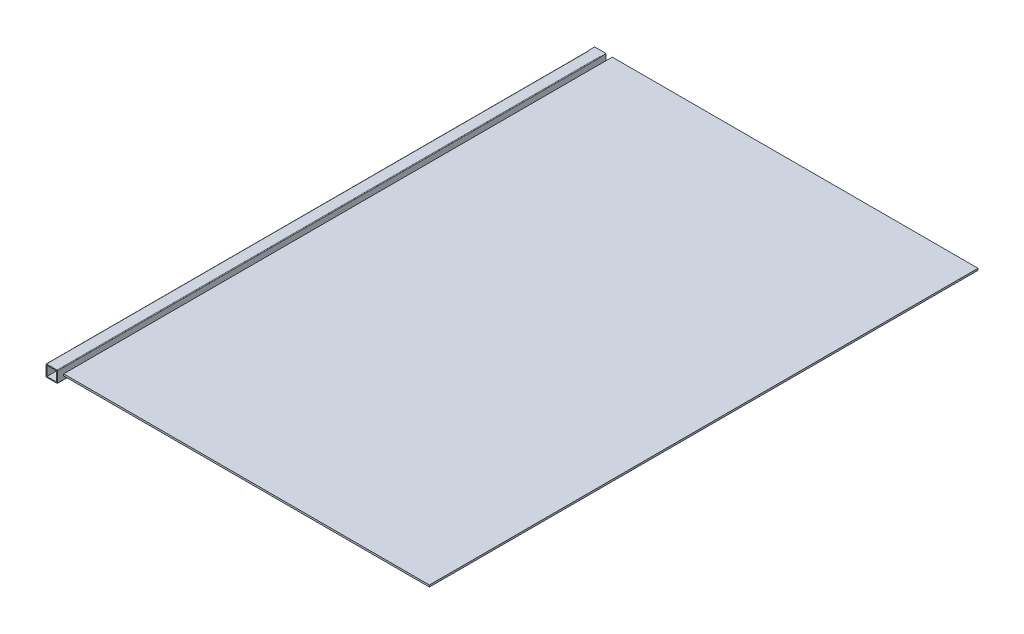
ISO-10303-21;
HEADER;
FILE_DESCRIPTION(('STEP AP214'),'2;1');
FILE_NAME('part.step','',(''),(''),'','','');
FILE_SCHEMA(('AUTOMOTIVE_DESIGN { 1 0 10303 214 1 1 1 1 }'));
ENDSEC;
DATA;
#1=APPLICATION_CONTEXT('core data for automotive mechanical design processes');
#2=APPLICATION_PROTOCOL_DEFINITION('international standard','automotive_design',2000,#1);
#3=PRODUCT_CONTEXT('',#1,'mechanical');
#4=PRODUCT('Part','Part','',(#3));
#5=PRODUCT_RELATED_PRODUCT_CATEGORY('part','',(#4));
#6=PRODUCT_DEFINITION_FORMATION('','',#4);
#7=PRODUCT_DEFINITION_CONTEXT('part definition',#1,'design');
#8=PRODUCT_DEFINITION('design','',#6,#7);
#9=PRODUCT_DEFINITION_SHAPE('','',#8);
#10=(LENGTH_UNIT() NAMED_UNIT(*) SI_UNIT(.MILLI.,.METRE.));
#11=(NAMED_UNIT(*) PLANE_ANGLE_UNIT() SI_UNIT($,.RADIAN.));
#12=(NAMED_UNIT(*) SI_UNIT($,.STERADIAN.) SOLID_ANGLE_UNIT());
#13=UNCERTAINTY_MEASURE_WITH_UNIT(LENGTH_MEASURE(1.E-05),#10,'distance_accuracy_value','');
#14=(GEOMETRIC_REPRESENTATION_CONTEXT(3) GLOBAL_UNCERTAINTY_ASSIGNED_CONTEXT((#13)) GLOBAL_UNIT_ASSIGNED_CONTEXT((#10,
#11,#12)) REPRESENTATION_CONTEXT('',''));
#15=CARTESIAN_POINT('',(0.,0.,0.));
#16=DIRECTION('',(0.,0.,1.));
#17=DIRECTION('',(1.,0.,0.));
#18=AXIS2_PLACEMENT_3D('',#15,#16,#17);
#19=CARTESIAN_POINT('',(29.,0.,900.));
#20=DIRECTION('',(1.,0.,0.));
#21=DIRECTION('',(0.,1.,0.));
#22=AXIS2_PLACEMENT_3D('',#19,#20,#21);
#23=PLANE('',#22);
#24=DIRECTION('',(0.,0.,-1.));
#25=VECTOR('',#24,1.);
#26=CARTESIAN_POINT('',(29.,0.,900.));
#27=LINE('',#26,#25);
#28=CARTESIAN_POINT('',(29.,0.,900.));
#29=VERTEX_POINT('',#28);
#30=CARTESIAN_POINT('',(29.,0.,0.));
#31=VERTEX_POINT('',#30);
#32=EDGE_CURVE('E83',#29,#31,#27,.T.);
#33=ORIENTED_EDGE('',*,*,#32,.T.);
#34=DIRECTION('',(0.,-1.,0.));
#35=VECTOR('',#34,1.);
#36=CARTESIAN_POINT('',(29.,0.,0.));
#37=LINE('',#36,#35);
#38=CARTESIAN_POINT('',(29.,-3.,0.));
#39=VERTEX_POINT('',#38);
#40=EDGE_CURVE('E107',#31,#39,#37,.T.);
#41=ORIENTED_EDGE('',*,*,#40,.T.);
#42=DIRECTION('',(0.,0.,-1.));
#43=VECTOR('',#42,1.);
#44=CARTESIAN_POINT('',(29.,-3.,900.));
#45=LINE('',#44,#43);
#46=CARTESIAN_POINT('',(29.,-3.,900.));
#47=VERTEX_POINT('',#46);
#48=EDGE_CURVE('E12',#47,#39,#45,.T.);
#49=ORIENTED_EDGE('',*,*,#48,.F.);
#50=DIRECTION('',(0.,-1.,0.));
#51=VECTOR('',#50,1.);
#52=CARTESIAN_POINT('',(29.,0.,900.));
#53=LINE('',#52,#51);
#54=EDGE_CURVE('E93',#29,#47,#53,.T.);
#55=ORIENTED_EDGE('',*,*,#54,.F.);
#56=EDGE_LOOP('',(#33,#41,#49,#55));
#57=FACE_BOUND('',#56,.T.);
#58=ADVANCED_FACE('F45',(#57),#23,.F.);
#59=CARTESIAN_POINT('',(29.,-3.,900.));
#60=DIRECTION('',(0.,1.,0.));
#61=DIRECTION('',(0.,0.,1.));
#62=AXIS2_PLACEMENT_3D('',#59,#60,#61);
#63=PLANE('',#62);
#64=ORIENTED_EDGE('',*,*,#48,.T.);
#65=DIRECTION('',(1.,0.,0.));
#66=VECTOR('',#65,1.);
#67=CARTESIAN_POINT('',(29.,-3.,0.));
#68=LINE('',#67,#66);
#69=CARTESIAN_POINT('',(629.,-3.,0.));
#70=VERTEX_POINT('',#69);
#71=EDGE_CURVE('E99',#39,#70,#68,.T.);
#72=ORIENTED_EDGE('',*,*,#71,.T.);
#73=DIRECTION('',(0.,0.,-1.));
#74=VECTOR('',#73,1.);
#75=CARTESIAN_POINT('',(629.,-3.,900.));
#76=LINE('',#75,#74);
#77=CARTESIAN_POINT('',(629.,-3.,900.));
#78=VERTEX_POINT('',#77);
#79=EDGE_CURVE('E53',#78,#70,#76,.T.);
#80=ORIENTED_EDGE('',*,*,#79,.F.);
#81=DIRECTION('',(1.,0.,0.));
#82=VECTOR('',#81,1.);
#83=CARTESIAN_POINT('',(29.,-3.,900.));
#84=LINE('',#83,#82);
#85=EDGE_CURVE('E89',#47,#78,#84,.T.);
#86=ORIENTED_EDGE('',*,*,#85,.F.);
#87=EDGE_LOOP('',(#64,#72,#80,#86));
#88=FACE_BOUND('',#87,.T.);
#89=ADVANCED_FACE('F97',(#88),#63,.F.);
#90=CARTESIAN_POINT('',(629.,0.,900.));
#91=DIRECTION('',(-1.,0.,0.));
#92=DIRECTION('',(0.,0.,1.));
#93=AXIS2_PLACEMENT_3D('',#90,#91,#92);
#94=PLANE('',#93);
#95=ORIENTED_EDGE('',*,*,#79,.T.);
#96=DIRECTION('',(0.,1.,0.));
#97=VECTOR('',#96,1.);
#98=CARTESIAN_POINT('',(629.,0.,0.));
#99=LINE('',#98,#97);
#100=CARTESIAN_POINT('',(629.,0.,0.));
#101=VERTEX_POINT('',#100);
#102=EDGE_CURVE('E110',#70,#101,#99,.T.);
#103=ORIENTED_EDGE('',*,*,#102,.T.);
#104=DIRECTION('',(0.,0.,-1.));
#105=VECTOR('',#104,1.);
#106=CARTESIAN_POINT('',(629.,0.,900.));
#107=LINE('',#106,#105);
#108=CARTESIAN_POINT('',(629.,0.,900.));
#109=VERTEX_POINT('',#108);
#110=EDGE_CURVE('E76',#109,#101,#107,.T.);
#111=ORIENTED_EDGE('',*,*,#110,.F.);
#112=DIRECTION('',(0.,1.,0.));
#113=VECTOR('',#112,1.);
#114=CARTESIAN_POINT('',(629.,0.,900.));
#115=LINE('',#114,#113);
#116=EDGE_CURVE('E92',#78,#109,#115,.T.);
#117=ORIENTED_EDGE('',*,*,#116,.F.);
#118=EDGE_LOOP('',(#95,#103,#111,#117));
#119=FACE_BOUND('',#118,.T.);
#120=ADVANCED_FACE('F102',(#119),#94,.F.);
#121=CARTESIAN_POINT('',(29.,0.,900.));
#122=DIRECTION('',(0.,-1.,0.));
#123=DIRECTION('',(0.,0.,-1.));
#124=AXIS2_PLACEMENT_3D('',#121,#122,#123);
#125=PLANE('',#124);
#126=ORIENTED_EDGE('',*,*,#110,.T.);
#127=DIRECTION('',(-1.,0.,0.));
#128=VECTOR('',#127,1.);
#129=CARTESIAN_POINT('',(29.,0.,0.));
#130=LINE('',#129,#128);
#131=EDGE_CURVE('E112',#101,#31,#130,.T.);
#132=ORIENTED_EDGE('',*,*,#131,.T.);
#133=ORIENTED_EDGE('',*,*,#32,.F.);
#134=DIRECTION('',(-1.,0.,0.));
#135=VECTOR('',#134,1.);
#136=CARTESIAN_POINT('',(29.,0.,900.));
#137=LINE('',#136,#135);
#138=EDGE_CURVE('E61',#109,#29,#137,.T.);
#139=ORIENTED_EDGE('',*,*,#138,.F.);
#140=EDGE_LOOP('',(#126,#132,#133,#139));
#141=FACE_BOUND('',#140,.T.);
#142=ADVANCED_FACE('F117',(#141),#125,.F.);
#143=CARTESIAN_POINT('',(0.,0.,900.));
#144=DIRECTION('',(0.,0.,1.));
#145=DIRECTION('',(1.,0.,0.));
#146=AXIS2_PLACEMENT_3D('',#143,#144,#145);
#147=PLANE('',#146);
#148=ORIENTED_EDGE('',*,*,#54,.T.);
#149=ORIENTED_EDGE('',*,*,#85,.T.);
#150=ORIENTED_EDGE('',*,*,#116,.T.);
#151=ORIENTED_EDGE('',*,*,#138,.T.);
#152=EDGE_LOOP('',(#148,#149,#150,#151));
#153=FACE_BOUND('',#152,.T.);
#154=ADVANCED_FACE('F90',(#153),#147,.T.);
#155=CARTESIAN_POINT('',(0.,0.,0.));
#156=DIRECTION('',(0.,0.,1.));
#157=DIRECTION('',(1.,0.,0.));
#158=AXIS2_PLACEMENT_3D('',#155,#156,#157);
#159=PLANE('',#158);
#160=ORIENTED_EDGE('',*,*,#40,.F.);
#161=ORIENTED_EDGE('',*,*,#131,.F.);
#162=ORIENTED_EDGE('',*,*,#102,.F.);
#163=ORIENTED_EDGE('',*,*,#71,.F.);
#164=EDGE_LOOP('',(#160,#161,#162,#163));
#165=FACE_BOUND('',#164,.T.);
#166=ADVANCED_FACE('F119',(#165),#159,.F.);
#167=CLOSED_SHELL('',(#58,#89,#120,#142,#154,#166));
#168=MANIFOLD_SOLID_BREP('B2',#167);
#169=CARTESIAN_POINT('',(0.,0.,900.));
#170=DIRECTION('',(0.,0.,1.));
#171=DIRECTION('',(1.,0.,0.));
#172=AXIS2_PLACEMENT_3D('',#169,#170,#171);
#173=PLANE('',#172);
#174=DIRECTION('',(0.,-1.,0.));
#175=VECTOR('',#174,1.);
#176=CARTESIAN_POINT('',(0.,0.,900.));
#177=LINE('',#176,#175);
#178=CARTESIAN_POINT('',(0.,-1.,900.));
#179=VERTEX_POINT('',#178);
#180=CARTESIAN_POINT('',(0.,-18.,900.));
#181=VERTEX_POINT('',#180);
#182=EDGE_CURVE('E348',#179,#181,#177,.T.);
#183=ORIENTED_EDGE('',*,*,#182,.T.);
#184=CARTESIAN_POINT('',(1.,-18.,900.));
#185=DIRECTION('',(0.,0.,1.));
#186=DIRECTION('',(1.,0.,0.));
#187=AXIS2_PLACEMENT_3D('',#184,#185,#186);
#188=CIRCLE('',#187,1.);
#189=CARTESIAN_POINT('',(1.,-19.,900.));
#190=VERTEX_POINT('',#189);
#191=EDGE_CURVE('E380',#181,#190,#188,.T.);
#192=ORIENTED_EDGE('',*,*,#191,.T.);
#193=DIRECTION('',(1.,0.,0.));
#194=VECTOR('',#193,1.);
#195=CARTESIAN_POINT('',(0.,-19.,900.));
#196=LINE('',#195,#194);
#197=CARTESIAN_POINT('',(18.,-19.,900.));
#198=VERTEX_POINT('',#197);
#199=EDGE_CURVE('E351',#190,#198,#196,.T.);
#200=ORIENTED_EDGE('',*,*,#199,.T.);
#201=CARTESIAN_POINT('',(18.,-18.,900.));
#202=DIRECTION('',(0.,0.,1.));
#203=DIRECTION('',(1.,0.,0.));
#204=AXIS2_PLACEMENT_3D('',#201,#202,#203);
#205=CIRCLE('',#204,1.);
#206=CARTESIAN_POINT('',(19.,-18.,900.));
#207=VERTEX_POINT('',#206);
#208=EDGE_CURVE('E376',#198,#207,#205,.T.);
#209=ORIENTED_EDGE('',*,*,#208,.T.);
#210=DIRECTION('',(0.,1.,0.));
#211=VECTOR('',#210,1.);
#212=CARTESIAN_POINT('',(19.,0.,900.));
#213=LINE('',#212,#211);
#214=CARTESIAN_POINT('',(19.,-1.,900.));
#215=VERTEX_POINT('',#214);
#216=EDGE_CURVE('E355',#207,#215,#213,.T.);
#217=ORIENTED_EDGE('',*,*,#216,.T.);
#218=CARTESIAN_POINT('',(18.,-1.,900.));
#219=DIRECTION('',(0.,0.,1.));
#220=DIRECTION('',(1.,0.,0.));
#221=AXIS2_PLACEMENT_3D('',#218,#219,#220);
#222=CIRCLE('',#221,1.);
#223=CARTESIAN_POINT('',(18.,0.,900.));
#224=VERTEX_POINT('',#223);
#225=EDGE_CURVE('E374',#215,#224,#222,.T.);
#226=ORIENTED_EDGE('',*,*,#225,.T.);
#227=DIRECTION('',(-1.,0.,0.));
#228=VECTOR('',#227,1.);
#229=CARTESIAN_POINT('',(0.,0.,900.));
#230=LINE('',#229,#228);
#231=CARTESIAN_POINT('',(1.,0.,900.));
#232=VERTEX_POINT('',#231);
#233=EDGE_CURVE('E358',#224,#232,#230,.T.);
#234=ORIENTED_EDGE('',*,*,#233,.T.);
#235=CARTESIAN_POINT('',(1.,-1.,900.));
#236=DIRECTION('',(0.,0.,1.));
#237=DIRECTION('',(1.,0.,0.));
#238=AXIS2_PLACEMENT_3D('',#235,#236,#237);
#239=CIRCLE('',#238,1.);
#240=EDGE_CURVE('E378',#232,#179,#239,.T.);
#241=ORIENTED_EDGE('',*,*,#240,.T.);
#242=EDGE_LOOP('',(#183,#192,#200,#209,#217,#226,#234,#241));
#243=FACE_BOUND('',#242,.T.);
#244=DIRECTION('',(1.,0.,0.));
#245=VECTOR('',#244,1.);
#246=CARTESIAN_POINT('',(1.56,-17.44,900.));
#247=LINE('',#246,#245);
#248=CARTESIAN_POINT('',(1.56,-17.44,900.));
#249=VERTEX_POINT('',#248);
#250=CARTESIAN_POINT('',(17.44,-17.44,900.));
#251=VERTEX_POINT('',#250);
#252=EDGE_CURVE('E322',#249,#251,#247,.T.);
#253=ORIENTED_EDGE('',*,*,#252,.F.);
#254=DIRECTION('',(0.,-1.,0.));
#255=VECTOR('',#254,1.);
#256=CARTESIAN_POINT('',(1.56,-1.56,900.));
#257=LINE('',#256,#255);
#258=CARTESIAN_POINT('',(1.56,-1.56,900.));
#259=VERTEX_POINT('',#258);
#260=EDGE_CURVE('E320',#259,#249,#257,.T.);
#261=ORIENTED_EDGE('',*,*,#260,.F.);
#262=DIRECTION('',(-1.,0.,0.));
#263=VECTOR('',#262,1.);
#264=CARTESIAN_POINT('',(1.56,-1.56,900.));
#265=LINE('',#264,#263);
#266=CARTESIAN_POINT('',(17.44,-1.56,900.));
#267=VERTEX_POINT('',#266);
#268=EDGE_CURVE('E328',#267,#259,#265,.T.);
#269=ORIENTED_EDGE('',*,*,#268,.F.);
#270=DIRECTION('',(0.,1.,0.));
#271=VECTOR('',#270,1.);
#272=CARTESIAN_POINT('',(17.44,-1.56,900.));
#273=LINE('',#272,#271);
#274=EDGE_CURVE('E325',#251,#267,#273,.T.);
#275=ORIENTED_EDGE('',*,*,#274,.F.);
#276=EDGE_LOOP('',(#253,#261,#269,#275));
#277=FACE_BOUND('',#276,.T.);
#278=ADVANCED_FACE('F169',(#243,#277),#173,.T.);
#279=CARTESIAN_POINT('',(0.,0.,0.));
#280=DIRECTION('',(0.,0.,1.));
#281=DIRECTION('',(1.,0.,0.));
#282=AXIS2_PLACEMENT_3D('',#279,#280,#281);
#283=PLANE('',#282);
#284=DIRECTION('',(1.,0.,0.));
#285=VECTOR('',#284,1.);
#286=CARTESIAN_POINT('',(0.,-19.,0.));
#287=LINE('',#286,#285);
#288=CARTESIAN_POINT('',(0.,-19.,0.));
#289=VERTEX_POINT('',#288);
#290=CARTESIAN_POINT('',(19.,-19.,0.));
#291=VERTEX_POINT('',#290);
#292=EDGE_CURVE('E362',#289,#291,#287,.T.);
#293=ORIENTED_EDGE('',*,*,#292,.F.);
#294=DIRECTION('',(0.,-1.,0.));
#295=VECTOR('',#294,1.);
#296=CARTESIAN_POINT('',(0.,0.,0.));
#297=LINE('',#296,#295);
#298=CARTESIAN_POINT('',(0.,0.,0.));
#299=VERTEX_POINT('',#298);
#300=EDGE_CURVE('E305',#299,#289,#297,.T.);
#301=ORIENTED_EDGE('',*,*,#300,.F.);
#302=DIRECTION('',(-1.,0.,0.));
#303=VECTOR('',#302,1.);
#304=CARTESIAN_POINT('',(0.,0.,0.));
#305=LINE('',#304,#303);
#306=CARTESIAN_POINT('',(19.,0.,0.));
#307=VERTEX_POINT('',#306);
#308=EDGE_CURVE('E352',#307,#299,#305,.T.);
#309=ORIENTED_EDGE('',*,*,#308,.F.);
#310=DIRECTION('',(0.,1.,0.));
#311=VECTOR('',#310,1.);
#312=CARTESIAN_POINT('',(19.,0.,0.));
#313=LINE('',#312,#311);
#314=EDGE_CURVE('E364',#291,#307,#313,.T.);
#315=ORIENTED_EDGE('',*,*,#314,.F.);
#316=EDGE_LOOP('',(#293,#301,#309,#315));
#317=FACE_BOUND('',#316,.T.);
#318=DIRECTION('',(0.,-1.,0.));
#319=VECTOR('',#318,1.);
#320=CARTESIAN_POINT('',(1.56,-1.56,0.));
#321=LINE('',#320,#319);
#322=CARTESIAN_POINT('',(1.56,-1.56,0.));
#323=VERTEX_POINT('',#322);
#324=CARTESIAN_POINT('',(1.56,-17.44,0.));
#325=VERTEX_POINT('',#324);
#326=EDGE_CURVE('E319',#323,#325,#321,.T.);
#327=ORIENTED_EDGE('',*,*,#326,.T.);
#328=DIRECTION('',(1.,0.,0.));
#329=VECTOR('',#328,1.);
#330=CARTESIAN_POINT('',(1.56,-17.44,0.));
#331=LINE('',#330,#329);
#332=CARTESIAN_POINT('',(17.44,-17.44,0.));
#333=VERTEX_POINT('',#332);
#334=EDGE_CURVE('E333',#325,#333,#331,.T.);
#335=ORIENTED_EDGE('',*,*,#334,.T.);
#336=DIRECTION('',(0.,1.,0.));
#337=VECTOR('',#336,1.);
#338=CARTESIAN_POINT('',(17.44,-1.56,0.));
#339=LINE('',#338,#337);
#340=CARTESIAN_POINT('',(17.44,-1.56,0.));
#341=VERTEX_POINT('',#340);
#342=EDGE_CURVE('E336',#333,#341,#339,.T.);
#343=ORIENTED_EDGE('',*,*,#342,.T.);
#344=DIRECTION('',(-1.,0.,0.));
#345=VECTOR('',#344,1.);
#346=CARTESIAN_POINT('',(1.56,-1.56,0.));
#347=LINE('',#346,#345);
#348=EDGE_CURVE('E323',#341,#323,#347,.T.);
#349=ORIENTED_EDGE('',*,*,#348,.T.);
#350=EDGE_LOOP('',(#327,#335,#343,#349));
#351=FACE_BOUND('',#350,.T.);
#352=ADVANCED_FACE('F417',(#317,#351),#283,.F.);
#353=CARTESIAN_POINT('',(0.,0.,900.));
#354=DIRECTION('',(1.,0.,0.));
#355=DIRECTION('',(0.,1.,0.));
#356=AXIS2_PLACEMENT_3D('',#353,#354,#355);
#357=PLANE('',#356);
#358=DIRECTION('',(0.,0.,-1.));
#359=VECTOR('',#358,1.);
#360=CARTESIAN_POINT('',(0.,-1.,900.));
#361=LINE('',#360,#359);
#362=CARTESIAN_POINT('',(0.,-1.,10.));
#363=VERTEX_POINT('',#362);
#364=EDGE_CURVE('E370',#179,#363,#361,.T.);
#365=ORIENTED_EDGE('',*,*,#364,.T.);
#366=DIRECTION('',(0.,-1.,0.));
#367=VECTOR('',#366,1.);
#368=CARTESIAN_POINT('',(0.,0.,10.));
#369=LINE('',#368,#367);
#370=CARTESIAN_POINT('',(0.,0.,10.));
#371=VERTEX_POINT('',#370);
#372=EDGE_CURVE('E289',#371,#363,#369,.T.);
#373=ORIENTED_EDGE('',*,*,#372,.F.);
#374=DIRECTION('',(0.,0.,-1.));
#375=VECTOR('',#374,1.);
#376=CARTESIAN_POINT('',(0.,0.,10.));
#377=LINE('',#376,#375);
#378=EDGE_CURVE('E407',#371,#299,#377,.T.);
#379=ORIENTED_EDGE('',*,*,#378,.T.);
#380=ORIENTED_EDGE('',*,*,#300,.T.);
#381=DIRECTION('',(0.,0.,-1.));
#382=VECTOR('',#381,1.);
#383=CARTESIAN_POINT('',(0.,-19.,10.));
#384=LINE('',#383,#382);
#385=CARTESIAN_POINT('',(0.,-19.,10.));
#386=VERTEX_POINT('',#385);
#387=EDGE_CURVE('E295',#386,#289,#384,.T.);
#388=ORIENTED_EDGE('',*,*,#387,.F.);
#389=CARTESIAN_POINT('',(0.,-18.,10.));
#390=VERTEX_POINT('',#389);
#391=EDGE_CURVE('E280',#390,#386,#369,.T.);
#392=ORIENTED_EDGE('',*,*,#391,.F.);
#393=DIRECTION('',(0.,0.,-1.));
#394=VECTOR('',#393,1.);
#395=CARTESIAN_POINT('',(0.,-18.,900.));
#396=LINE('',#395,#394);
#397=EDGE_CURVE('E372',#390,#181,#396,.F.);
#398=ORIENTED_EDGE('',*,*,#397,.T.);
#399=ORIENTED_EDGE('',*,*,#182,.F.);
#400=EDGE_LOOP('',(#365,#373,#379,#380,#388,#392,#398,#399));
#401=FACE_BOUND('',#400,.T.);
#402=ADVANCED_FACE('F303',(#401),#357,.F.);
#403=CARTESIAN_POINT('',(0.,-19.,900.));
#404=DIRECTION('',(0.,1.,0.));
#405=DIRECTION('',(0.,0.,1.));
#406=AXIS2_PLACEMENT_3D('',#403,#404,#405);
#407=PLANE('',#406);
#408=DIRECTION('',(0.,0.,-1.));
#409=VECTOR('',#408,1.);
#410=CARTESIAN_POINT('',(1.,-19.,900.));
#411=LINE('',#410,#409);
#412=CARTESIAN_POINT('',(1.,-19.,10.));
#413=VERTEX_POINT('',#412);
#414=EDGE_CURVE('E298',#190,#413,#411,.T.);
#415=ORIENTED_EDGE('',*,*,#414,.T.);
#416=DIRECTION('',(1.,0.,0.));
#417=VECTOR('',#416,1.);
#418=CARTESIAN_POINT('',(0.,-19.,10.));
#419=LINE('',#418,#417);
#420=EDGE_CURVE('E283',#386,#413,#419,.T.);
#421=ORIENTED_EDGE('',*,*,#420,.F.);
#422=ORIENTED_EDGE('',*,*,#387,.T.);
#423=ORIENTED_EDGE('',*,*,#292,.T.);
#424=DIRECTION('',(0.,0.,-1.));
#425=VECTOR('',#424,1.);
#426=CARTESIAN_POINT('',(19.,-19.,10.));
#427=LINE('',#426,#425);
#428=CARTESIAN_POINT('',(19.,-19.,10.));
#429=VERTEX_POINT('',#428);
#430=EDGE_CURVE('E308',#429,#291,#427,.T.);
#431=ORIENTED_EDGE('',*,*,#430,.F.);
#432=CARTESIAN_POINT('',(18.,-19.,10.));
#433=VERTEX_POINT('',#432);
#434=EDGE_CURVE('E300',#433,#429,#419,.T.);
#435=ORIENTED_EDGE('',*,*,#434,.F.);
#436=DIRECTION('',(0.,0.,-1.));
#437=VECTOR('',#436,1.);
#438=CARTESIAN_POINT('',(18.,-19.,900.));
#439=LINE('',#438,#437);
#440=EDGE_CURVE('E360',#433,#198,#439,.F.);
#441=ORIENTED_EDGE('',*,*,#440,.T.);
#442=ORIENTED_EDGE('',*,*,#199,.F.);
#443=EDGE_LOOP('',(#415,#421,#422,#423,#431,#435,#441,#442));
#444=FACE_BOUND('',#443,.T.);
#445=ADVANCED_FACE('F294',(#444),#407,.F.);
#446=CARTESIAN_POINT('',(19.,0.,900.));
#447=DIRECTION('',(-1.,0.,0.));
#448=DIRECTION('',(0.,0.,1.));
#449=AXIS2_PLACEMENT_3D('',#446,#447,#448);
#450=PLANE('',#449);
#451=DIRECTION('',(0.,0.,-1.));
#452=VECTOR('',#451,1.);
#453=CARTESIAN_POINT('',(19.,-18.,900.));
#454=LINE('',#453,#452);
#455=CARTESIAN_POINT('',(19.,-18.,10.));
#456=VERTEX_POINT('',#455);
#457=EDGE_CURVE('E177',#207,#456,#454,.T.);
#458=ORIENTED_EDGE('',*,*,#457,.T.);
#459=DIRECTION('',(0.,1.,0.));
#460=VECTOR('',#459,1.);
#461=CARTESIAN_POINT('',(19.,0.,10.));
#462=LINE('',#461,#460);
#463=EDGE_CURVE('E393',#429,#456,#462,.T.);
#464=ORIENTED_EDGE('',*,*,#463,.F.);
#465=ORIENTED_EDGE('',*,*,#430,.T.);
#466=ORIENTED_EDGE('',*,*,#314,.T.);
#467=DIRECTION('',(0.,0.,-1.));
#468=VECTOR('',#467,1.);
#469=CARTESIAN_POINT('',(19.,0.,10.));
#470=LINE('',#469,#468);
#471=CARTESIAN_POINT('',(19.,0.,10.));
#472=VERTEX_POINT('',#471);
#473=EDGE_CURVE('E313',#472,#307,#470,.T.);
#474=ORIENTED_EDGE('',*,*,#473,.F.);
#475=CARTESIAN_POINT('',(19.,-1.,10.));
#476=VERTEX_POINT('',#475);
#477=EDGE_CURVE('E299',#476,#472,#462,.T.);
#478=ORIENTED_EDGE('',*,*,#477,.F.);
#479=DIRECTION('',(0.,0.,-1.));
#480=VECTOR('',#479,1.);
#481=CARTESIAN_POINT('',(19.,-1.,900.));
#482=LINE('',#481,#480);
#483=EDGE_CURVE('E386',#476,#215,#482,.F.);
#484=ORIENTED_EDGE('',*,*,#483,.T.);
#485=ORIENTED_EDGE('',*,*,#216,.F.);
#486=EDGE_LOOP('',(#458,#464,#465,#466,#474,#478,#484,#485));
#487=FACE_BOUND('',#486,.T.);
#488=ADVANCED_FACE('F392',(#487),#450,.F.);
#489=CARTESIAN_POINT('',(0.,0.,900.));
#490=DIRECTION('',(0.,-1.,0.));
#491=DIRECTION('',(0.,0.,-1.));
#492=AXIS2_PLACEMENT_3D('',#489,#490,#491);
#493=PLANE('',#492);
#494=DIRECTION('',(0.,0.,-1.));
#495=VECTOR('',#494,1.);
#496=CARTESIAN_POINT('',(18.,0.,900.));
#497=LINE('',#496,#495);
#498=CARTESIAN_POINT('',(18.,0.,10.));
#499=VERTEX_POINT('',#498);
#500=EDGE_CURVE('E382',#224,#499,#497,.T.);
#501=ORIENTED_EDGE('',*,*,#500,.T.);
#502=DIRECTION('',(-1.,0.,0.));
#503=VECTOR('',#502,1.);
#504=CARTESIAN_POINT('',(0.,0.,10.));
#505=LINE('',#504,#503);
#506=EDGE_CURVE('E405',#472,#499,#505,.T.);
#507=ORIENTED_EDGE('',*,*,#506,.F.);
#508=ORIENTED_EDGE('',*,*,#473,.T.);
#509=ORIENTED_EDGE('',*,*,#308,.T.);
#510=ORIENTED_EDGE('',*,*,#378,.F.);
#511=CARTESIAN_POINT('',(1.,0.,10.));
#512=VERTEX_POINT('',#511);
#513=EDGE_CURVE('E184',#512,#371,#505,.T.);
#514=ORIENTED_EDGE('',*,*,#513,.F.);
#515=DIRECTION('',(0.,0.,-1.));
#516=VECTOR('',#515,1.);
#517=CARTESIAN_POINT('',(1.,0.,900.));
#518=LINE('',#517,#516);
#519=EDGE_CURVE('E189',#512,#232,#518,.F.);
#520=ORIENTED_EDGE('',*,*,#519,.T.);
#521=ORIENTED_EDGE('',*,*,#233,.F.);
#522=EDGE_LOOP('',(#501,#507,#508,#509,#510,#514,#520,#521));
#523=FACE_BOUND('',#522,.T.);
#524=ADVANCED_FACE('F411',(#523),#493,.F.);
#525=CARTESIAN_POINT('',(1.56,-1.56,900.));
#526=DIRECTION('',(1.,0.,0.));
#527=DIRECTION('',(0.,1.,0.));
#528=AXIS2_PLACEMENT_3D('',#525,#526,#527);
#529=PLANE('',#528);
#530=DIRECTION('',(0.,0.,-1.));
#531=VECTOR('',#530,1.);
#532=CARTESIAN_POINT('',(1.56,-17.44,900.));
#533=LINE('',#532,#531);
#534=EDGE_CURVE('E346',#249,#325,#533,.T.);
#535=ORIENTED_EDGE('',*,*,#534,.T.);
#536=ORIENTED_EDGE('',*,*,#326,.F.);
#537=DIRECTION('',(0.,0.,-1.));
#538=VECTOR('',#537,1.);
#539=CARTESIAN_POINT('',(1.56,-1.56,900.));
#540=LINE('',#539,#538);
#541=EDGE_CURVE('E330',#259,#323,#540,.T.);
#542=ORIENTED_EDGE('',*,*,#541,.F.);
#543=ORIENTED_EDGE('',*,*,#260,.T.);
#544=EDGE_LOOP('',(#535,#536,#542,#543));
#545=FACE_BOUND('',#544,.T.);
#546=ADVANCED_FACE('F426',(#545),#529,.T.);
#547=CARTESIAN_POINT('',(1.56,-17.44,900.));
#548=DIRECTION('',(0.,1.,0.));
#549=DIRECTION('',(0.,0.,1.));
#550=AXIS2_PLACEMENT_3D('',#547,#548,#549);
#551=PLANE('',#550);
#552=DIRECTION('',(0.,0.,-1.));
#553=VECTOR('',#552,1.);
#554=CARTESIAN_POINT('',(17.44,-17.44,900.));
#555=LINE('',#554,#553);
#556=EDGE_CURVE('E344',#251,#333,#555,.T.);
#557=ORIENTED_EDGE('',*,*,#556,.T.);
#558=ORIENTED_EDGE('',*,*,#334,.F.);
#559=ORIENTED_EDGE('',*,*,#534,.F.);
#560=ORIENTED_EDGE('',*,*,#252,.T.);
#561=EDGE_LOOP('',(#557,#558,#559,#560));
#562=FACE_BOUND('',#561,.T.);
#563=ADVANCED_FACE('F431',(#562),#551,.T.);
#564=CARTESIAN_POINT('',(17.44,-1.56,900.));
#565=DIRECTION('',(-1.,0.,0.));
#566=DIRECTION('',(0.,-1.,0.));
#567=AXIS2_PLACEMENT_3D('',#564,#565,#566);
#568=PLANE('',#567);
#569=DIRECTION('',(0.,0.,-1.));
#570=VECTOR('',#569,1.);
#571=CARTESIAN_POINT('',(17.44,-1.56,900.));
#572=LINE('',#571,#570);
#573=EDGE_CURVE('E342',#267,#341,#572,.T.);
#574=ORIENTED_EDGE('',*,*,#573,.T.);
#575=ORIENTED_EDGE('',*,*,#342,.F.);
#576=ORIENTED_EDGE('',*,*,#556,.F.);
#577=ORIENTED_EDGE('',*,*,#274,.T.);
#578=EDGE_LOOP('',(#574,#575,#576,#577));
#579=FACE_BOUND('',#578,.T.);
#580=ADVANCED_FACE('F436',(#579),#568,.T.);
#581=CARTESIAN_POINT('',(1.56,-1.56,900.));
#582=DIRECTION('',(0.,-1.,0.));
#583=DIRECTION('',(0.,0.,-1.));
#584=AXIS2_PLACEMENT_3D('',#581,#582,#583);
#585=PLANE('',#584);
#586=ORIENTED_EDGE('',*,*,#541,.T.);
#587=ORIENTED_EDGE('',*,*,#348,.F.);
#588=ORIENTED_EDGE('',*,*,#573,.F.);
#589=ORIENTED_EDGE('',*,*,#268,.T.);
#590=EDGE_LOOP('',(#586,#587,#588,#589));
#591=FACE_BOUND('',#590,.T.);
#592=ADVANCED_FACE('F439',(#591),#585,.T.);
#593=CARTESIAN_POINT('',(1.,-18.,900.));
#594=DIRECTION('',(0.,0.,-1.));
#595=DIRECTION('',(-1.,0.,0.));
#596=AXIS2_PLACEMENT_3D('',#593,#594,#595);
#597=CYLINDRICAL_SURFACE('',#596,1.);
#598=CARTESIAN_POINT('',(1.,-18.,10.));
#599=DIRECTION('',(0.,0.,1.));
#600=DIRECTION('',(1.,0.,0.));
#601=AXIS2_PLACEMENT_3D('',#598,#599,#600);
#602=CIRCLE('',#601,1.);
#603=EDGE_CURVE('E285',#413,#390,#602,.F.);
#604=ORIENTED_EDGE('',*,*,#603,.F.);
#605=ORIENTED_EDGE('',*,*,#414,.F.);
#606=ORIENTED_EDGE('',*,*,#191,.F.);
#607=ORIENTED_EDGE('',*,*,#397,.F.);
#608=EDGE_LOOP('',(#604,#605,#606,#607));
#609=FACE_BOUND('',#608,.T.);
#610=ADVANCED_FACE('F457',(#609),#597,.T.);
#611=CARTESIAN_POINT('',(1.,-1.,900.));
#612=DIRECTION('',(0.,0.,-1.));
#613=DIRECTION('',(-1.,0.,0.));
#614=AXIS2_PLACEMENT_3D('',#611,#612,#613);
#615=CYLINDRICAL_SURFACE('',#614,1.);
#616=CARTESIAN_POINT('',(1.,-1.,10.));
#617=DIRECTION('',(0.,0.,1.));
#618=DIRECTION('',(1.,0.,0.));
#619=AXIS2_PLACEMENT_3D('',#616,#617,#618);
#620=CIRCLE('',#619,1.);
#621=EDGE_CURVE('E310',#363,#512,#620,.F.);
#622=ORIENTED_EDGE('',*,*,#621,.F.);
#623=ORIENTED_EDGE('',*,*,#364,.F.);
#624=ORIENTED_EDGE('',*,*,#240,.F.);
#625=ORIENTED_EDGE('',*,*,#519,.F.);
#626=EDGE_LOOP('',(#622,#623,#624,#625));
#627=FACE_BOUND('',#626,.T.);
#628=ADVANCED_FACE('F460',(#627),#615,.T.);
#629=CARTESIAN_POINT('',(18.,-18.,900.));
#630=DIRECTION('',(0.,0.,-1.));
#631=DIRECTION('',(-1.,0.,0.));
#632=AXIS2_PLACEMENT_3D('',#629,#630,#631);
#633=CYLINDRICAL_SURFACE('',#632,1.);
#634=CARTESIAN_POINT('',(18.,-18.,10.));
#635=DIRECTION('',(0.,0.,1.));
#636=DIRECTION('',(1.,0.,0.));
#637=AXIS2_PLACEMENT_3D('',#634,#635,#636);
#638=CIRCLE('',#637,1.);
#639=EDGE_CURVE('E307',#456,#433,#638,.F.);
#640=ORIENTED_EDGE('',*,*,#639,.F.);
#641=ORIENTED_EDGE('',*,*,#457,.F.);
#642=ORIENTED_EDGE('',*,*,#208,.F.);
#643=ORIENTED_EDGE('',*,*,#440,.F.);
#644=EDGE_LOOP('',(#640,#641,#642,#643));
#645=FACE_BOUND('',#644,.T.);
#646=ADVANCED_FACE('F397',(#645),#633,.T.);
#647=CARTESIAN_POINT('',(18.,-1.,900.));
#648=DIRECTION('',(0.,0.,-1.));
#649=DIRECTION('',(-1.,0.,0.));
#650=AXIS2_PLACEMENT_3D('',#647,#648,#649);
#651=CYLINDRICAL_SURFACE('',#650,1.);
#652=CARTESIAN_POINT('',(18.,-1.,10.));
#653=DIRECTION('',(0.,0.,1.));
#654=DIRECTION('',(1.,0.,0.));
#655=AXIS2_PLACEMENT_3D('',#652,#653,#654);
#656=CIRCLE('',#655,1.);
#657=EDGE_CURVE('E43',#499,#476,#656,.F.);
#658=ORIENTED_EDGE('',*,*,#657,.F.);
#659=ORIENTED_EDGE('',*,*,#500,.F.);
#660=ORIENTED_EDGE('',*,*,#225,.F.);
#661=ORIENTED_EDGE('',*,*,#483,.F.);
#662=EDGE_LOOP('',(#658,#659,#660,#661));
#663=FACE_BOUND('',#662,.T.);
#664=ADVANCED_FACE('F171',(#663),#651,.T.);
#665=CARTESIAN_POINT('',(0.,0.,10.));
#666=DIRECTION('',(0.,0.,1.));
#667=DIRECTION('',(1.,0.,0.));
#668=AXIS2_PLACEMENT_3D('',#665,#666,#667);
#669=PLANE('',#668);
#670=ORIENTED_EDGE('',*,*,#506,.T.);
#671=ORIENTED_EDGE('',*,*,#657,.T.);
#672=ORIENTED_EDGE('',*,*,#477,.T.);
#673=EDGE_LOOP('',(#670,#671,#672));
#674=FACE_BOUND('',#673,.T.);
#675=ADVANCED_FACE('F468',(#674),#669,.T.);
#676=ORIENTED_EDGE('',*,*,#463,.T.);
#677=ORIENTED_EDGE('',*,*,#639,.T.);
#678=ORIENTED_EDGE('',*,*,#434,.T.);
#679=EDGE_LOOP('',(#676,#677,#678));
#680=FACE_BOUND('',#679,.T.);
#681=ADVANCED_FACE('F401',(#680),#669,.T.);
#682=ORIENTED_EDGE('',*,*,#372,.T.);
#683=ORIENTED_EDGE('',*,*,#621,.T.);
#684=ORIENTED_EDGE('',*,*,#513,.T.);
#685=EDGE_LOOP('',(#682,#683,#684));
#686=FACE_BOUND('',#685,.T.);
#687=ADVANCED_FACE('F485',(#686),#669,.T.);
#688=ORIENTED_EDGE('',*,*,#420,.T.);
#689=ORIENTED_EDGE('',*,*,#603,.T.);
#690=ORIENTED_EDGE('',*,*,#391,.T.);
#691=EDGE_LOOP('',(#688,#689,#690));
#692=FACE_BOUND('',#691,.T.);
#693=ADVANCED_FACE('F282',(#692),#669,.T.);
#694=CLOSED_SHELL('',(#278,#352,#402,#445,#488,#524,#546,#563,#580,#592,#610,#628,#646,#664,
#675,#681,#687,#693));
#695=MANIFOLD_SOLID_BREP('B6_NOT_SHOWN',#694);
#696=ADVANCED_BREP_SHAPE_REPRESENTATION('',(#18,#168,#695),#14);
#697=SHAPE_DEFINITION_REPRESENTATION(#9,#696);
ENDSEC;
END-ISO-10303-21;
